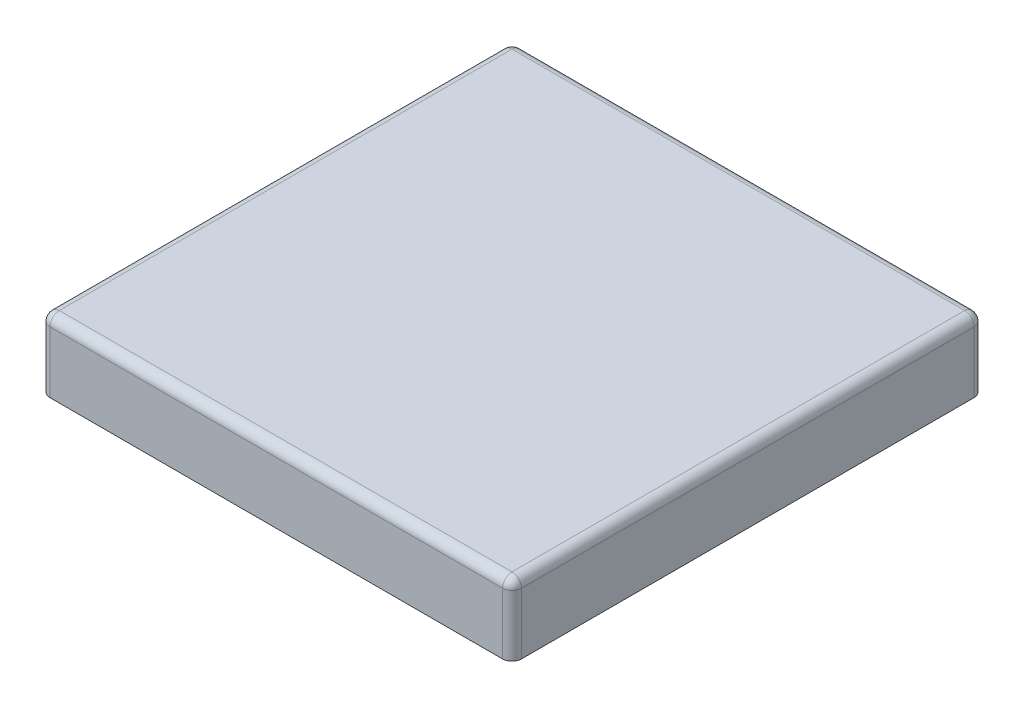
ISO-10303-21;
HEADER;
FILE_DESCRIPTION(('STEP AP214'),'2;1');
FILE_NAME('part.step','',(''),(''),'','','');
FILE_SCHEMA(('AUTOMOTIVE_DESIGN { 1 0 10303 214 1 1 1 1 }'));
ENDSEC;
DATA;
#1=APPLICATION_CONTEXT('core data for automotive mechanical design processes');
#2=APPLICATION_PROTOCOL_DEFINITION('international standard','automotive_design',2000,#1);
#3=PRODUCT_CONTEXT('',#1,'mechanical');
#4=PRODUCT('Part','Part','',(#3));
#5=PRODUCT_RELATED_PRODUCT_CATEGORY('part','',(#4));
#6=PRODUCT_DEFINITION_FORMATION('','',#4);
#7=PRODUCT_DEFINITION_CONTEXT('part definition',#1,'design');
#8=PRODUCT_DEFINITION('design','',#6,#7);
#9=PRODUCT_DEFINITION_SHAPE('','',#8);
#10=(LENGTH_UNIT() NAMED_UNIT(*) SI_UNIT(.MILLI.,.METRE.));
#11=(NAMED_UNIT(*) PLANE_ANGLE_UNIT() SI_UNIT($,.RADIAN.));
#12=(NAMED_UNIT(*) SI_UNIT($,.STERADIAN.) SOLID_ANGLE_UNIT());
#13=UNCERTAINTY_MEASURE_WITH_UNIT(LENGTH_MEASURE(1.E-05),#10,'distance_accuracy_value','');
#14=(GEOMETRIC_REPRESENTATION_CONTEXT(3) GLOBAL_UNCERTAINTY_ASSIGNED_CONTEXT((#13)) GLOBAL_UNIT_ASSIGNED_CONTEXT((#10,
#11,#12)) REPRESENTATION_CONTEXT('',''));
#15=CARTESIAN_POINT('',(0.,0.,0.));
#16=DIRECTION('',(0.,0.,1.));
#17=DIRECTION('',(1.,0.,0.));
#18=AXIS2_PLACEMENT_3D('',#15,#16,#17);
#19=CARTESIAN_POINT('',(-500.,150.,-500.));
#20=DIRECTION('',(1.,0.,0.));
#21=DIRECTION('',(0.,0.,-1.));
#22=AXIS2_PLACEMENT_3D('',#19,#20,#21);
#23=PLANE('',#22);
#24=DIRECTION('',(0.,0.,1.));
#25=VECTOR('',#24,1.);
#26=CARTESIAN_POINT('',(-500.,0.,-500.));
#27=LINE('',#26,#25);
#28=CARTESIAN_POINT('',(-500.,0.,-480.));
#29=VERTEX_POINT('',#28);
#30=CARTESIAN_POINT('',(-500.,0.,480.));
#31=VERTEX_POINT('',#30);
#32=EDGE_CURVE('E247',#29,#31,#27,.T.);
#33=ORIENTED_EDGE('',*,*,#32,.T.);
#34=DIRECTION('',(0.,-1.,0.));
#35=VECTOR('',#34,1.);
#36=CARTESIAN_POINT('',(-500.,150.,480.));
#37=LINE('',#36,#35);
#38=CARTESIAN_POINT('',(-500.,130.,480.));
#39=VERTEX_POINT('',#38);
#40=EDGE_CURVE('E58',#31,#39,#37,.F.);
#41=ORIENTED_EDGE('',*,*,#40,.T.);
#42=DIRECTION('',(0.,0.,1.));
#43=VECTOR('',#42,1.);
#44=CARTESIAN_POINT('',(-500.,130.,-500.));
#45=LINE('',#44,#43);
#46=CARTESIAN_POINT('',(-500.,130.,-480.));
#47=VERTEX_POINT('',#46);
#48=EDGE_CURVE('E63',#39,#47,#45,.F.);
#49=ORIENTED_EDGE('',*,*,#48,.T.);
#50=DIRECTION('',(0.,-1.,0.));
#51=VECTOR('',#50,1.);
#52=CARTESIAN_POINT('',(-500.,150.,-480.));
#53=LINE('',#52,#51);
#54=EDGE_CURVE('E190',#47,#29,#53,.T.);
#55=ORIENTED_EDGE('',*,*,#54,.T.);
#56=EDGE_LOOP('',(#33,#41,#49,#55));
#57=FACE_BOUND('',#56,.T.);
#58=ADVANCED_FACE('F40',(#57),#23,.F.);
#59=CARTESIAN_POINT('',(-500.,150.,500.));
#60=DIRECTION('',(0.,0.,-1.));
#61=DIRECTION('',(-1.,0.,0.));
#62=AXIS2_PLACEMENT_3D('',#59,#60,#61);
#63=PLANE('',#62);
#64=DIRECTION('',(1.,0.,0.));
#65=VECTOR('',#64,1.);
#66=CARTESIAN_POINT('',(-500.,0.,500.));
#67=LINE('',#66,#65);
#68=CARTESIAN_POINT('',(-480.,0.,500.));
#69=VERTEX_POINT('',#68);
#70=CARTESIAN_POINT('',(480.,0.,500.));
#71=VERTEX_POINT('',#70);
#72=EDGE_CURVE('E253',#69,#71,#67,.T.);
#73=ORIENTED_EDGE('',*,*,#72,.T.);
#74=DIRECTION('',(0.,-1.,0.));
#75=VECTOR('',#74,1.);
#76=CARTESIAN_POINT('',(480.,150.,500.));
#77=LINE('',#76,#75);
#78=CARTESIAN_POINT('',(480.,130.,500.));
#79=VERTEX_POINT('',#78);
#80=EDGE_CURVE('E187',#71,#79,#77,.F.);
#81=ORIENTED_EDGE('',*,*,#80,.T.);
#82=DIRECTION('',(1.,0.,0.));
#83=VECTOR('',#82,1.);
#84=CARTESIAN_POINT('',(-500.,130.,500.));
#85=LINE('',#84,#83);
#86=CARTESIAN_POINT('',(-480.,130.,500.));
#87=VERTEX_POINT('',#86);
#88=EDGE_CURVE('E184',#79,#87,#85,.F.);
#89=ORIENTED_EDGE('',*,*,#88,.T.);
#90=DIRECTION('',(0.,-1.,0.));
#91=VECTOR('',#90,1.);
#92=CARTESIAN_POINT('',(-480.,150.,500.));
#93=LINE('',#92,#91);
#94=EDGE_CURVE('E181',#87,#69,#93,.T.);
#95=ORIENTED_EDGE('',*,*,#94,.T.);
#96=EDGE_LOOP('',(#73,#81,#89,#95));
#97=FACE_BOUND('',#96,.T.);
#98=ADVANCED_FACE('F307',(#97),#63,.F.);
#99=CARTESIAN_POINT('',(500.,150.,-500.));
#100=DIRECTION('',(-1.,0.,0.));
#101=DIRECTION('',(0.,0.,1.));
#102=AXIS2_PLACEMENT_3D('',#99,#100,#101);
#103=PLANE('',#102);
#104=DIRECTION('',(0.,0.,-1.));
#105=VECTOR('',#104,1.);
#106=CARTESIAN_POINT('',(500.,0.,-500.));
#107=LINE('',#106,#105);
#108=CARTESIAN_POINT('',(500.,0.,480.));
#109=VERTEX_POINT('',#108);
#110=CARTESIAN_POINT('',(500.,0.,-480.));
#111=VERTEX_POINT('',#110);
#112=EDGE_CURVE('E257',#109,#111,#107,.T.);
#113=ORIENTED_EDGE('',*,*,#112,.T.);
#114=DIRECTION('',(0.,-1.,0.));
#115=VECTOR('',#114,1.);
#116=CARTESIAN_POINT('',(500.,150.,-480.));
#117=LINE('',#116,#115);
#118=CARTESIAN_POINT('',(500.,130.,-480.));
#119=VERTEX_POINT('',#118);
#120=EDGE_CURVE('E178',#111,#119,#117,.F.);
#121=ORIENTED_EDGE('',*,*,#120,.T.);
#122=DIRECTION('',(0.,0.,-1.));
#123=VECTOR('',#122,1.);
#124=CARTESIAN_POINT('',(500.,130.,500.));
#125=LINE('',#124,#123);
#126=CARTESIAN_POINT('',(500.,130.,480.));
#127=VERTEX_POINT('',#126);
#128=EDGE_CURVE('E175',#119,#127,#125,.F.);
#129=ORIENTED_EDGE('',*,*,#128,.T.);
#130=DIRECTION('',(0.,-1.,0.));
#131=VECTOR('',#130,1.);
#132=CARTESIAN_POINT('',(500.,150.,480.));
#133=LINE('',#132,#131);
#134=EDGE_CURVE('E172',#127,#109,#133,.T.);
#135=ORIENTED_EDGE('',*,*,#134,.T.);
#136=EDGE_LOOP('',(#113,#121,#129,#135));
#137=FACE_BOUND('',#136,.T.);
#138=ADVANCED_FACE('F313',(#137),#103,.F.);
#139=CARTESIAN_POINT('',(-500.,150.,-500.));
#140=DIRECTION('',(0.,0.,1.));
#141=DIRECTION('',(1.,0.,0.));
#142=AXIS2_PLACEMENT_3D('',#139,#140,#141);
#143=PLANE('',#142);
#144=DIRECTION('',(-1.,0.,0.));
#145=VECTOR('',#144,1.);
#146=CARTESIAN_POINT('',(500.,130.,-500.));
#147=LINE('',#146,#145);
#148=CARTESIAN_POINT('',(-480.,130.,-500.));
#149=VERTEX_POINT('',#148);
#150=CARTESIAN_POINT('',(480.,130.,-500.));
#151=VERTEX_POINT('',#150);
#152=EDGE_CURVE('E126',#149,#151,#147,.F.);
#153=ORIENTED_EDGE('',*,*,#152,.T.);
#154=DIRECTION('',(0.,-1.,0.));
#155=VECTOR('',#154,1.);
#156=CARTESIAN_POINT('',(480.,150.,-500.));
#157=LINE('',#156,#155);
#158=CARTESIAN_POINT('',(480.,0.,-500.));
#159=VERTEX_POINT('',#158);
#160=EDGE_CURVE('E169',#151,#159,#157,.T.);
#161=ORIENTED_EDGE('',*,*,#160,.T.);
#162=DIRECTION('',(-1.,0.,0.));
#163=VECTOR('',#162,1.);
#164=CARTESIAN_POINT('',(-500.,0.,-500.));
#165=LINE('',#164,#163);
#166=CARTESIAN_POINT('',(-480.,0.,-500.));
#167=VERTEX_POINT('',#166);
#168=EDGE_CURVE('E152',#159,#167,#165,.T.);
#169=ORIENTED_EDGE('',*,*,#168,.T.);
#170=DIRECTION('',(0.,-1.,0.));
#171=VECTOR('',#170,1.);
#172=CARTESIAN_POINT('',(-480.,150.,-500.));
#173=LINE('',#172,#171);
#174=EDGE_CURVE('E159',#167,#149,#173,.F.);
#175=ORIENTED_EDGE('',*,*,#174,.T.);
#176=EDGE_LOOP('',(#153,#161,#169,#175));
#177=FACE_BOUND('',#176,.T.);
#178=ADVANCED_FACE('F283',(#177),#143,.F.);
#179=CARTESIAN_POINT('',(0.,150.,0.));
#180=DIRECTION('',(0.,1.,0.));
#181=DIRECTION('',(0.,0.,1.));
#182=AXIS2_PLACEMENT_3D('',#179,#180,#181);
#183=PLANE('',#182);
#184=DIRECTION('',(0.,0.,-1.));
#185=VECTOR('',#184,1.);
#186=CARTESIAN_POINT('',(480.,150.,-500.));
#187=LINE('',#186,#185);
#188=CARTESIAN_POINT('',(480.,150.,480.));
#189=VERTEX_POINT('',#188);
#190=CARTESIAN_POINT('',(480.,150.,-480.));
#191=VERTEX_POINT('',#190);
#192=EDGE_CURVE('E156',#189,#191,#187,.T.);
#193=ORIENTED_EDGE('',*,*,#192,.T.);
#194=DIRECTION('',(-1.,0.,0.));
#195=VECTOR('',#194,1.);
#196=CARTESIAN_POINT('',(-500.,150.,-480.));
#197=LINE('',#196,#195);
#198=CARTESIAN_POINT('',(-480.,150.,-480.));
#199=VERTEX_POINT('',#198);
#200=EDGE_CURVE('E124',#191,#199,#197,.T.);
#201=ORIENTED_EDGE('',*,*,#200,.T.);
#202=DIRECTION('',(0.,0.,1.));
#203=VECTOR('',#202,1.);
#204=CARTESIAN_POINT('',(-480.,150.,500.));
#205=LINE('',#204,#203);
#206=CARTESIAN_POINT('',(-480.,150.,480.));
#207=VERTEX_POINT('',#206);
#208=EDGE_CURVE('E144',#199,#207,#205,.T.);
#209=ORIENTED_EDGE('',*,*,#208,.T.);
#210=DIRECTION('',(1.,0.,0.));
#211=VECTOR('',#210,1.);
#212=CARTESIAN_POINT('',(500.,150.,480.));
#213=LINE('',#212,#211);
#214=EDGE_CURVE('E151',#207,#189,#213,.T.);
#215=ORIENTED_EDGE('',*,*,#214,.T.);
#216=EDGE_LOOP('',(#193,#201,#209,#215));
#217=FACE_BOUND('',#216,.T.);
#218=ADVANCED_FACE('F154',(#217),#183,.T.);
#219=CARTESIAN_POINT('',(0.,0.,0.));
#220=DIRECTION('',(0.,1.,0.));
#221=DIRECTION('',(0.,0.,1.));
#222=AXIS2_PLACEMENT_3D('',#219,#220,#221);
#223=PLANE('',#222);
#224=CARTESIAN_POINT('',(460.,0.,400.));
#225=DIRECTION('',(0.,-1.,0.));
#226=DIRECTION('',(0.,0.,1.));
#227=AXIS2_PLACEMENT_3D('',#224,#225,#226);
#228=CIRCLE('',#227,10.);
#229=CARTESIAN_POINT('',(460.,0.,410.));
#230=VERTEX_POINT('',#229);
#231=EDGE_CURVE('E553',#230,#230,#228,.T.);
#232=ORIENTED_EDGE('',*,*,#231,.F.);
#233=EDGE_LOOP('',(#232));
#234=FACE_BOUND('',#233,.T.);
#235=CARTESIAN_POINT('',(-460.,0.,400.));
#236=DIRECTION('',(0.,1.,0.));
#237=DIRECTION('',(0.,0.,1.));
#238=AXIS2_PLACEMENT_3D('',#235,#236,#237);
#239=CIRCLE('',#238,10.);
#240=CARTESIAN_POINT('',(-460.,0.,410.));
#241=VERTEX_POINT('',#240);
#242=EDGE_CURVE('E557',#241,#241,#239,.T.);
#243=ORIENTED_EDGE('',*,*,#242,.T.);
#244=EDGE_LOOP('',(#243));
#245=FACE_BOUND('',#244,.T.);
#246=CARTESIAN_POINT('',(460.,0.,-400.));
#247=DIRECTION('',(0.,1.,0.));
#248=DIRECTION('',(0.,0.,-1.));
#249=AXIS2_PLACEMENT_3D('',#246,#247,#248);
#250=CIRCLE('',#249,10.);
#251=CARTESIAN_POINT('',(460.,0.,-410.));
#252=VERTEX_POINT('',#251);
#253=EDGE_CURVE('E561',#252,#252,#250,.T.);
#254=ORIENTED_EDGE('',*,*,#253,.T.);
#255=EDGE_LOOP('',(#254));
#256=FACE_BOUND('',#255,.T.);
#257=CARTESIAN_POINT('',(-460.,0.,-400.));
#258=DIRECTION('',(0.,-1.,0.));
#259=DIRECTION('',(0.,0.,-1.));
#260=AXIS2_PLACEMENT_3D('',#257,#258,#259);
#261=CIRCLE('',#260,10.);
#262=CARTESIAN_POINT('',(-460.,0.,-410.));
#263=VERTEX_POINT('',#262);
#264=EDGE_CURVE('E565',#263,#263,#261,.T.);
#265=ORIENTED_EDGE('',*,*,#264,.F.);
#266=EDGE_LOOP('',(#265));
#267=FACE_BOUND('',#266,.T.);
#268=CARTESIAN_POINT('',(0.,0.,0.));
#269=DIRECTION('',(0.,-1.,0.));
#270=DIRECTION('',(0.,0.,-1.));
#271=AXIS2_PLACEMENT_3D('',#268,#269,#270);
#272=CIRCLE('',#271,300.);
#273=CARTESIAN_POINT('',(0.,0.,-300.));
#274=VERTEX_POINT('',#273);
#275=EDGE_CURVE('E237',#274,#274,#272,.T.);
#276=ORIENTED_EDGE('',*,*,#275,.F.);
#277=EDGE_LOOP('',(#276));
#278=FACE_BOUND('',#277,.T.);
#279=ORIENTED_EDGE('',*,*,#168,.F.);
#280=CARTESIAN_POINT('',(480.,0.,-480.));
#281=DIRECTION('',(0.,1.,0.));
#282=DIRECTION('',(0.,0.,1.));
#283=AXIS2_PLACEMENT_3D('',#280,#281,#282);
#284=CIRCLE('',#283,20.);
#285=EDGE_CURVE('E11',#159,#111,#284,.F.);
#286=ORIENTED_EDGE('',*,*,#285,.T.);
#287=ORIENTED_EDGE('',*,*,#112,.F.);
#288=CARTESIAN_POINT('',(480.,0.,480.));
#289=DIRECTION('',(0.,1.,0.));
#290=DIRECTION('',(0.,0.,1.));
#291=AXIS2_PLACEMENT_3D('',#288,#289,#290);
#292=CIRCLE('',#291,20.);
#293=EDGE_CURVE('E50',#109,#71,#292,.F.);
#294=ORIENTED_EDGE('',*,*,#293,.T.);
#295=ORIENTED_EDGE('',*,*,#72,.F.);
#296=CARTESIAN_POINT('',(-480.,0.,480.));
#297=DIRECTION('',(0.,1.,0.));
#298=DIRECTION('',(0.,0.,1.));
#299=AXIS2_PLACEMENT_3D('',#296,#297,#298);
#300=CIRCLE('',#299,20.);
#301=EDGE_CURVE('E200',#69,#31,#300,.F.);
#302=ORIENTED_EDGE('',*,*,#301,.T.);
#303=ORIENTED_EDGE('',*,*,#32,.F.);
#304=CARTESIAN_POINT('',(-480.,0.,-480.));
#305=DIRECTION('',(0.,1.,0.));
#306=DIRECTION('',(0.,0.,1.));
#307=AXIS2_PLACEMENT_3D('',#304,#305,#306);
#308=CIRCLE('',#307,20.);
#309=EDGE_CURVE('E197',#29,#167,#308,.F.);
#310=ORIENTED_EDGE('',*,*,#309,.T.);
#311=EDGE_LOOP('',(#279,#286,#287,#294,#295,#302,#303,#310));
#312=FACE_BOUND('',#311,.T.);
#313=ADVANCED_FACE('F290',(#234,#245,#256,#267,#278,#312),#223,.F.);
#314=CARTESIAN_POINT('',(0.,100.,0.));
#315=DIRECTION('',(0.,-1.,0.));
#316=DIRECTION('',(0.,0.,-1.));
#317=AXIS2_PLACEMENT_3D('',#314,#315,#316);
#318=CYLINDRICAL_SURFACE('',#317,300.);
#319=CARTESIAN_POINT('',(0.,100.,0.));
#320=DIRECTION('',(0.,-1.,0.));
#321=DIRECTION('',(0.,0.,-1.));
#322=AXIS2_PLACEMENT_3D('',#319,#320,#321);
#323=CIRCLE('',#322,300.);
#324=CARTESIAN_POINT('',(0.,100.,-300.));
#325=VERTEX_POINT('',#324);
#326=EDGE_CURVE('E241',#325,#325,#323,.T.);
#327=ORIENTED_EDGE('',*,*,#326,.F.);
#328=EDGE_LOOP('',(#327));
#329=FACE_BOUND('',#328,.T.);
#330=ORIENTED_EDGE('',*,*,#275,.T.);
#331=EDGE_LOOP('',(#330));
#332=FACE_BOUND('',#331,.T.);
#333=ADVANCED_FACE('F488',(#329,#332),#318,.F.);
#334=CARTESIAN_POINT('',(0.,100.,0.));
#335=DIRECTION('',(0.,-1.,0.));
#336=DIRECTION('',(0.,0.,-1.));
#337=AXIS2_PLACEMENT_3D('',#334,#335,#336);
#338=PLANE('',#337);
#339=ORIENTED_EDGE('',*,*,#326,.T.);
#340=EDGE_LOOP('',(#339));
#341=FACE_BOUND('',#340,.T.);
#342=ADVANCED_FACE('F480',(#341),#338,.T.);
#343=CARTESIAN_POINT('',(480.,150.,480.));
#344=DIRECTION('',(0.,-1.,0.));
#345=DIRECTION('',(0.,0.,-1.));
#346=AXIS2_PLACEMENT_3D('',#343,#344,#345);
#347=CYLINDRICAL_SURFACE('',#346,20.);
#348=ORIENTED_EDGE('',*,*,#293,.F.);
#349=ORIENTED_EDGE('',*,*,#134,.F.);
#350=CARTESIAN_POINT('',(480.,130.,480.));
#351=DIRECTION('',(0.,1.,0.));
#352=DIRECTION('',(0.,0.,1.));
#353=AXIS2_PLACEMENT_3D('',#350,#351,#352);
#354=CIRCLE('',#353,20.);
#355=EDGE_CURVE('E44',#79,#127,#354,.T.);
#356=ORIENTED_EDGE('',*,*,#355,.F.);
#357=ORIENTED_EDGE('',*,*,#80,.F.);
#358=EDGE_LOOP('',(#348,#349,#356,#357));
#359=FACE_BOUND('',#358,.T.);
#360=ADVANCED_FACE('F42',(#359),#347,.T.);
#361=CARTESIAN_POINT('',(0.,130.,480.));
#362=DIRECTION('',(-1.,0.,0.));
#363=DIRECTION('',(0.,0.,1.));
#364=AXIS2_PLACEMENT_3D('',#361,#362,#363);
#365=CYLINDRICAL_SURFACE('',#364,20.);
#366=CARTESIAN_POINT('',(-480.,130.,480.));
#367=DIRECTION('',(-1.,0.,0.));
#368=DIRECTION('',(0.,0.,1.));
#369=AXIS2_PLACEMENT_3D('',#366,#367,#368);
#370=CIRCLE('',#369,20.);
#371=EDGE_CURVE('E226',#87,#207,#370,.T.);
#372=ORIENTED_EDGE('',*,*,#371,.F.);
#373=ORIENTED_EDGE('',*,*,#88,.F.);
#374=CARTESIAN_POINT('',(480.,130.,480.));
#375=DIRECTION('',(1.,0.,0.));
#376=DIRECTION('',(0.,0.,-1.));
#377=AXIS2_PLACEMENT_3D('',#374,#375,#376);
#378=CIRCLE('',#377,20.);
#379=EDGE_CURVE('E229',#189,#79,#378,.T.);
#380=ORIENTED_EDGE('',*,*,#379,.F.);
#381=ORIENTED_EDGE('',*,*,#214,.F.);
#382=EDGE_LOOP('',(#372,#373,#380,#381));
#383=FACE_BOUND('',#382,.T.);
#384=ADVANCED_FACE('F267',(#383),#365,.T.);
#385=CARTESIAN_POINT('',(-480.,150.,480.));
#386=DIRECTION('',(0.,-1.,0.));
#387=DIRECTION('',(0.,0.,-1.));
#388=AXIS2_PLACEMENT_3D('',#385,#386,#387);
#389=CYLINDRICAL_SURFACE('',#388,20.);
#390=ORIENTED_EDGE('',*,*,#301,.F.);
#391=ORIENTED_EDGE('',*,*,#94,.F.);
#392=CARTESIAN_POINT('',(-480.,130.,480.));
#393=DIRECTION('',(0.,1.,0.));
#394=DIRECTION('',(0.,0.,1.));
#395=AXIS2_PLACEMENT_3D('',#392,#393,#394);
#396=CIRCLE('',#395,20.);
#397=EDGE_CURVE('E222',#39,#87,#396,.T.);
#398=ORIENTED_EDGE('',*,*,#397,.F.);
#399=ORIENTED_EDGE('',*,*,#40,.F.);
#400=EDGE_LOOP('',(#390,#391,#398,#399));
#401=FACE_BOUND('',#400,.T.);
#402=ADVANCED_FACE('F295',(#401),#389,.T.);
#403=CARTESIAN_POINT('',(480.,130.,480.));
#404=DIRECTION('',(0.,0.,1.));
#405=DIRECTION('',(1.,0.,0.));
#406=AXIS2_PLACEMENT_3D('',#403,#404,#405);
#407=SPHERICAL_SURFACE('',#406,20.);
#408=ORIENTED_EDGE('',*,*,#379,.T.);
#409=ORIENTED_EDGE('',*,*,#355,.T.);
#410=CARTESIAN_POINT('',(480.,130.,480.));
#411=DIRECTION('',(0.,0.,1.));
#412=DIRECTION('',(1.,0.,0.));
#413=AXIS2_PLACEMENT_3D('',#410,#411,#412);
#414=CIRCLE('',#413,20.);
#415=EDGE_CURVE('E218',#189,#127,#414,.F.);
#416=ORIENTED_EDGE('',*,*,#415,.F.);
#417=EDGE_LOOP('',(#408,#409,#416));
#418=FACE_BOUND('',#417,.T.);
#419=ADVANCED_FACE('F268',(#418),#407,.T.);
#420=CARTESIAN_POINT('',(-480.,130.,480.));
#421=DIRECTION('',(0.,0.,1.));
#422=DIRECTION('',(1.,0.,0.));
#423=AXIS2_PLACEMENT_3D('',#420,#421,#422);
#424=SPHERICAL_SURFACE('',#423,20.);
#425=ORIENTED_EDGE('',*,*,#397,.T.);
#426=ORIENTED_EDGE('',*,*,#371,.T.);
#427=CARTESIAN_POINT('',(-480.,130.,480.));
#428=DIRECTION('',(0.,0.,1.));
#429=DIRECTION('',(1.,0.,0.));
#430=AXIS2_PLACEMENT_3D('',#427,#428,#429);
#431=CIRCLE('',#430,20.);
#432=EDGE_CURVE('E147',#39,#207,#431,.F.);
#433=ORIENTED_EDGE('',*,*,#432,.F.);
#434=EDGE_LOOP('',(#425,#426,#433));
#435=FACE_BOUND('',#434,.T.);
#436=ADVANCED_FACE('F297',(#435),#424,.T.);
#437=CARTESIAN_POINT('',(480.,150.,-480.));
#438=DIRECTION('',(0.,-1.,0.));
#439=DIRECTION('',(0.,0.,-1.));
#440=AXIS2_PLACEMENT_3D('',#437,#438,#439);
#441=CYLINDRICAL_SURFACE('',#440,20.);
#442=ORIENTED_EDGE('',*,*,#285,.F.);
#443=ORIENTED_EDGE('',*,*,#160,.F.);
#444=CARTESIAN_POINT('',(480.,130.,-480.));
#445=DIRECTION('',(0.,1.,0.));
#446=DIRECTION('',(0.,0.,1.));
#447=AXIS2_PLACEMENT_3D('',#444,#445,#446);
#448=CIRCLE('',#447,20.);
#449=EDGE_CURVE('E212',#119,#151,#448,.T.);
#450=ORIENTED_EDGE('',*,*,#449,.F.);
#451=ORIENTED_EDGE('',*,*,#120,.F.);
#452=EDGE_LOOP('',(#442,#443,#450,#451));
#453=FACE_BOUND('',#452,.T.);
#454=ADVANCED_FACE('F280',(#453),#441,.T.);
#455=CARTESIAN_POINT('',(480.,130.,0.));
#456=DIRECTION('',(0.,0.,1.));
#457=DIRECTION('',(1.,0.,0.));
#458=AXIS2_PLACEMENT_3D('',#455,#456,#457);
#459=CYLINDRICAL_SURFACE('',#458,20.);
#460=ORIENTED_EDGE('',*,*,#415,.T.);
#461=ORIENTED_EDGE('',*,*,#128,.F.);
#462=CARTESIAN_POINT('',(480.,130.,-480.));
#463=DIRECTION('',(0.,0.,-1.));
#464=DIRECTION('',(-1.,0.,0.));
#465=AXIS2_PLACEMENT_3D('',#462,#463,#464);
#466=CIRCLE('',#465,20.);
#467=EDGE_CURVE('E141',#191,#119,#466,.T.);
#468=ORIENTED_EDGE('',*,*,#467,.F.);
#469=ORIENTED_EDGE('',*,*,#192,.F.);
#470=EDGE_LOOP('',(#460,#461,#468,#469));
#471=FACE_BOUND('',#470,.T.);
#472=ADVANCED_FACE('F271',(#471),#459,.T.);
#473=CARTESIAN_POINT('',(-480.,130.,0.));
#474=DIRECTION('',(0.,0.,-1.));
#475=DIRECTION('',(-1.,0.,0.));
#476=AXIS2_PLACEMENT_3D('',#473,#474,#475);
#477=CYLINDRICAL_SURFACE('',#476,20.);
#478=ORIENTED_EDGE('',*,*,#432,.T.);
#479=ORIENTED_EDGE('',*,*,#208,.F.);
#480=CARTESIAN_POINT('',(-480.,130.,-480.));
#481=DIRECTION('',(0.,0.,-1.));
#482=DIRECTION('',(-1.,0.,0.));
#483=AXIS2_PLACEMENT_3D('',#480,#481,#482);
#484=CIRCLE('',#483,20.);
#485=EDGE_CURVE('E134',#47,#199,#484,.T.);
#486=ORIENTED_EDGE('',*,*,#485,.F.);
#487=ORIENTED_EDGE('',*,*,#48,.F.);
#488=EDGE_LOOP('',(#478,#479,#486,#487));
#489=FACE_BOUND('',#488,.T.);
#490=ADVANCED_FACE('F145',(#489),#477,.T.);
#491=CARTESIAN_POINT('',(-480.,150.,-480.));
#492=DIRECTION('',(0.,-1.,0.));
#493=DIRECTION('',(0.,0.,-1.));
#494=AXIS2_PLACEMENT_3D('',#491,#492,#493);
#495=CYLINDRICAL_SURFACE('',#494,20.);
#496=ORIENTED_EDGE('',*,*,#309,.F.);
#497=ORIENTED_EDGE('',*,*,#54,.F.);
#498=CARTESIAN_POINT('',(-480.,130.,-480.));
#499=DIRECTION('',(0.,1.,0.));
#500=DIRECTION('',(0.,0.,1.));
#501=AXIS2_PLACEMENT_3D('',#498,#499,#500);
#502=CIRCLE('',#501,20.);
#503=EDGE_CURVE('E138',#149,#47,#502,.T.);
#504=ORIENTED_EDGE('',*,*,#503,.F.);
#505=ORIENTED_EDGE('',*,*,#174,.F.);
#506=EDGE_LOOP('',(#496,#497,#504,#505));
#507=FACE_BOUND('',#506,.T.);
#508=ADVANCED_FACE('F287',(#507),#495,.T.);
#509=CARTESIAN_POINT('',(480.,130.,-480.));
#510=DIRECTION('',(1.,0.,0.));
#511=DIRECTION('',(0.,0.,-1.));
#512=AXIS2_PLACEMENT_3D('',#509,#510,#511);
#513=SPHERICAL_SURFACE('',#512,20.);
#514=ORIENTED_EDGE('',*,*,#467,.T.);
#515=ORIENTED_EDGE('',*,*,#449,.T.);
#516=CARTESIAN_POINT('',(480.,130.,-480.));
#517=DIRECTION('',(1.,0.,0.));
#518=DIRECTION('',(0.,0.,-1.));
#519=AXIS2_PLACEMENT_3D('',#516,#517,#518);
#520=CIRCLE('',#519,20.);
#521=EDGE_CURVE('E130',#191,#151,#520,.F.);
#522=ORIENTED_EDGE('',*,*,#521,.F.);
#523=EDGE_LOOP('',(#514,#515,#522));
#524=FACE_BOUND('',#523,.T.);
#525=ADVANCED_FACE('F275',(#524),#513,.T.);
#526=CARTESIAN_POINT('',(-480.,130.,-480.));
#527=DIRECTION('',(-1.,0.,0.));
#528=DIRECTION('',(0.,0.,1.));
#529=AXIS2_PLACEMENT_3D('',#526,#527,#528);
#530=SPHERICAL_SURFACE('',#529,20.);
#531=ORIENTED_EDGE('',*,*,#503,.T.);
#532=ORIENTED_EDGE('',*,*,#485,.T.);
#533=CARTESIAN_POINT('',(-480.,130.,-480.));
#534=DIRECTION('',(-1.,0.,0.));
#535=DIRECTION('',(0.,0.,1.));
#536=AXIS2_PLACEMENT_3D('',#533,#534,#535);
#537=CIRCLE('',#536,20.);
#538=EDGE_CURVE('E120',#149,#199,#537,.F.);
#539=ORIENTED_EDGE('',*,*,#538,.F.);
#540=EDGE_LOOP('',(#531,#532,#539));
#541=FACE_BOUND('',#540,.T.);
#542=ADVANCED_FACE('F136',(#541),#530,.T.);
#543=CARTESIAN_POINT('',(0.,130.,-480.));
#544=DIRECTION('',(1.,0.,0.));
#545=DIRECTION('',(0.,0.,-1.));
#546=AXIS2_PLACEMENT_3D('',#543,#544,#545);
#547=CYLINDRICAL_SURFACE('',#546,20.);
#548=ORIENTED_EDGE('',*,*,#521,.T.);
#549=ORIENTED_EDGE('',*,*,#152,.F.);
#550=ORIENTED_EDGE('',*,*,#538,.T.);
#551=ORIENTED_EDGE('',*,*,#200,.F.);
#552=EDGE_LOOP('',(#548,#549,#550,#551));
#553=FACE_BOUND('',#552,.T.);
#554=ADVANCED_FACE('F122',(#553),#547,.T.);
#555=CARTESIAN_POINT('',(-460.,100.,-400.));
#556=DIRECTION('',(0.,-1.,0.));
#557=DIRECTION('',(0.,0.,-1.));
#558=AXIS2_PLACEMENT_3D('',#555,#556,#557);
#559=CYLINDRICAL_SURFACE('',#558,10.);
#560=CARTESIAN_POINT('',(-460.,100.,-400.));
#561=DIRECTION('',(0.,-1.,0.));
#562=DIRECTION('',(0.,0.,-1.));
#563=AXIS2_PLACEMENT_3D('',#560,#561,#562);
#564=CIRCLE('',#563,10.);
#565=CARTESIAN_POINT('',(-460.,100.,-410.));
#566=VERTEX_POINT('',#565);
#567=EDGE_CURVE('E131',#566,#566,#564,.T.);
#568=ORIENTED_EDGE('',*,*,#567,.F.);
#569=EDGE_LOOP('',(#568));
#570=FACE_BOUND('',#569,.T.);
#571=ORIENTED_EDGE('',*,*,#264,.T.);
#572=EDGE_LOOP('',(#571));
#573=FACE_BOUND('',#572,.T.);
#574=ADVANCED_FACE('F320',(#570,#573),#559,.F.);
#575=CARTESIAN_POINT('',(-460.,100.,-400.));
#576=DIRECTION('',(0.,-1.,0.));
#577=DIRECTION('',(0.,0.,-1.));
#578=AXIS2_PLACEMENT_3D('',#575,#576,#577);
#579=PLANE('',#578);
#580=ORIENTED_EDGE('',*,*,#567,.T.);
#581=EDGE_LOOP('',(#580));
#582=FACE_BOUND('',#581,.T.);
#583=ADVANCED_FACE('F360',(#582),#579,.T.);
#584=CARTESIAN_POINT('',(460.,100.,-400.));
#585=DIRECTION('',(0.,-1.,0.));
#586=DIRECTION('',(0.,0.,-1.));
#587=AXIS2_PLACEMENT_3D('',#584,#585,#586);
#588=CYLINDRICAL_SURFACE('',#587,10.);
#589=CARTESIAN_POINT('',(460.,100.,-400.));
#590=DIRECTION('',(0.,1.,0.));
#591=DIRECTION('',(0.,0.,-1.));
#592=AXIS2_PLACEMENT_3D('',#589,#590,#591);
#593=CIRCLE('',#592,10.);
#594=CARTESIAN_POINT('',(460.,100.,-410.));
#595=VERTEX_POINT('',#594);
#596=EDGE_CURVE('E568',#595,#595,#593,.T.);
#597=ORIENTED_EDGE('',*,*,#596,.T.);
#598=EDGE_LOOP('',(#597));
#599=FACE_BOUND('',#598,.T.);
#600=ORIENTED_EDGE('',*,*,#253,.F.);
#601=EDGE_LOOP('',(#600));
#602=FACE_BOUND('',#601,.T.);
#603=ADVANCED_FACE('F368',(#599,#602),#588,.F.);
#604=CARTESIAN_POINT('',(460.,100.,-400.));
#605=DIRECTION('',(0.,-1.,0.));
#606=DIRECTION('',(0.,0.,-1.));
#607=AXIS2_PLACEMENT_3D('',#604,#605,#606);
#608=PLANE('',#607);
#609=ORIENTED_EDGE('',*,*,#596,.F.);
#610=EDGE_LOOP('',(#609));
#611=FACE_BOUND('',#610,.T.);
#612=ADVANCED_FACE('F376',(#611),#608,.T.);
#613=CARTESIAN_POINT('',(-460.,100.,400.));
#614=DIRECTION('',(0.,-1.,0.));
#615=DIRECTION('',(0.,0.,-1.));
#616=AXIS2_PLACEMENT_3D('',#613,#614,#615);
#617=CYLINDRICAL_SURFACE('',#616,10.);
#618=CARTESIAN_POINT('',(-460.,100.,400.));
#619=DIRECTION('',(0.,1.,0.));
#620=DIRECTION('',(0.,0.,1.));
#621=AXIS2_PLACEMENT_3D('',#618,#619,#620);
#622=CIRCLE('',#621,10.);
#623=CARTESIAN_POINT('',(-460.,100.,410.));
#624=VERTEX_POINT('',#623);
#625=EDGE_CURVE('E577',#624,#624,#622,.T.);
#626=ORIENTED_EDGE('',*,*,#625,.T.);
#627=EDGE_LOOP('',(#626));
#628=FACE_BOUND('',#627,.T.);
#629=ORIENTED_EDGE('',*,*,#242,.F.);
#630=EDGE_LOOP('',(#629));
#631=FACE_BOUND('',#630,.T.);
#632=ADVANCED_FACE('F384',(#628,#631),#617,.F.);
#633=CARTESIAN_POINT('',(-460.,100.,400.));
#634=DIRECTION('',(0.,-1.,0.));
#635=DIRECTION('',(0.,0.,1.));
#636=AXIS2_PLACEMENT_3D('',#633,#634,#635);
#637=PLANE('',#636);
#638=ORIENTED_EDGE('',*,*,#625,.F.);
#639=EDGE_LOOP('',(#638));
#640=FACE_BOUND('',#639,.T.);
#641=ADVANCED_FACE('F393',(#640),#637,.T.);
#642=CARTESIAN_POINT('',(460.,100.,400.));
#643=DIRECTION('',(0.,-1.,0.));
#644=DIRECTION('',(0.,0.,-1.));
#645=AXIS2_PLACEMENT_3D('',#642,#643,#644);
#646=CYLINDRICAL_SURFACE('',#645,10.);
#647=CARTESIAN_POINT('',(460.,100.,400.));
#648=DIRECTION('',(0.,-1.,0.));
#649=DIRECTION('',(0.,0.,1.));
#650=AXIS2_PLACEMENT_3D('',#647,#648,#649);
#651=CIRCLE('',#650,10.);
#652=CARTESIAN_POINT('',(460.,100.,410.));
#653=VERTEX_POINT('',#652);
#654=EDGE_CURVE('E581',#653,#653,#651,.T.);
#655=ORIENTED_EDGE('',*,*,#654,.F.);
#656=EDGE_LOOP('',(#655));
#657=FACE_BOUND('',#656,.T.);
#658=ORIENTED_EDGE('',*,*,#231,.T.);
#659=EDGE_LOOP('',(#658));
#660=FACE_BOUND('',#659,.T.);
#661=ADVANCED_FACE('F401',(#657,#660),#646,.F.);
#662=CARTESIAN_POINT('',(460.,100.,400.));
#663=DIRECTION('',(0.,-1.,0.));
#664=DIRECTION('',(0.,0.,1.));
#665=AXIS2_PLACEMENT_3D('',#662,#663,#664);
#666=PLANE('',#665);
#667=ORIENTED_EDGE('',*,*,#654,.T.);
#668=EDGE_LOOP('',(#667));
#669=FACE_BOUND('',#668,.T.);
#670=ADVANCED_FACE('F409',(#669),#666,.T.);
#671=CLOSED_SHELL('',(#58,#98,#138,#178,#218,#313,#333,#342,#360,#384,#402,#419,#436,#454,#472,
#490,#508,#525,#542,#554,#574,#583,#603,#612,#632,#641,#661,#670));
#672=MANIFOLD_SOLID_BREP('B2',#671);
#673=ADVANCED_BREP_SHAPE_REPRESENTATION('',(#18,#672),#14);
#674=SHAPE_DEFINITION_REPRESENTATION(#9,#673);
ENDSEC;
END-ISO-10303-21;
